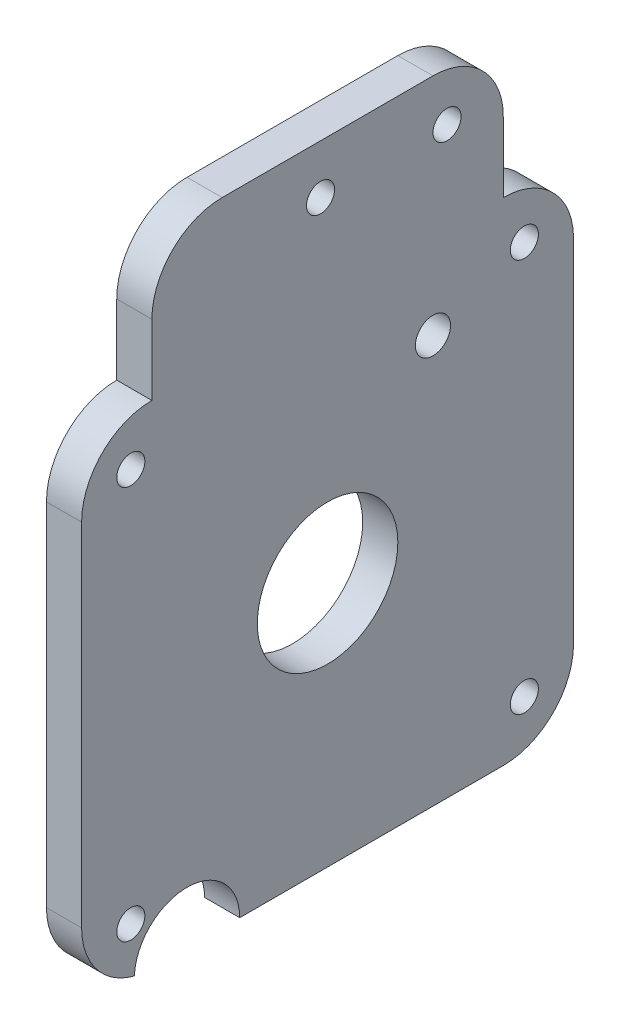
ISO-10303-21;
HEADER;
FILE_DESCRIPTION(('STEP AP214'),'2;1');
FILE_NAME('part.step','',(''),(''),'','','');
FILE_SCHEMA(('AUTOMOTIVE_DESIGN { 1 0 10303 214 1 1 1 1 }'));
ENDSEC;
DATA;
#1=APPLICATION_CONTEXT('core data for automotive mechanical design processes');
#2=APPLICATION_PROTOCOL_DEFINITION('international standard','automotive_design',2000,#1);
#3=PRODUCT_CONTEXT('',#1,'mechanical');
#4=PRODUCT('Part','Part','',(#3));
#5=PRODUCT_RELATED_PRODUCT_CATEGORY('part','',(#4));
#6=PRODUCT_DEFINITION_FORMATION('','',#4);
#7=PRODUCT_DEFINITION_CONTEXT('part definition',#1,'design');
#8=PRODUCT_DEFINITION('design','',#6,#7);
#9=PRODUCT_DEFINITION_SHAPE('','',#8);
#10=(LENGTH_UNIT() NAMED_UNIT(*) SI_UNIT(.MILLI.,.METRE.));
#11=(NAMED_UNIT(*) PLANE_ANGLE_UNIT() SI_UNIT($,.RADIAN.));
#12=(NAMED_UNIT(*) SI_UNIT($,.STERADIAN.) SOLID_ANGLE_UNIT());
#13=UNCERTAINTY_MEASURE_WITH_UNIT(LENGTH_MEASURE(1.E-05),#10,'distance_accuracy_value','');
#14=(GEOMETRIC_REPRESENTATION_CONTEXT(3) GLOBAL_UNCERTAINTY_ASSIGNED_CONTEXT((#13)) GLOBAL_UNIT_ASSIGNED_CONTEXT((#10,
#11,#12)) REPRESENTATION_CONTEXT('',''));
#15=CARTESIAN_POINT('',(0.,0.,0.));
#16=DIRECTION('',(0.,0.,1.));
#17=DIRECTION('',(1.,0.,0.));
#18=AXIS2_PLACEMENT_3D('',#15,#16,#17);
#19=CARTESIAN_POINT('',(5.,10.,-10.));
#20=DIRECTION('',(-1.,0.,0.));
#21=DIRECTION('',(0.,0.,1.));
#22=AXIS2_PLACEMENT_3D('',#19,#20,#21);
#23=PLANE('',#22);
#24=CARTESIAN_POINT('',(5.,58.,-50.));
#25=DIRECTION('',(1.,0.,0.));
#26=DIRECTION('',(0.,0.,-1.));
#27=AXIS2_PLACEMENT_3D('',#24,#25,#26);
#28=CIRCLE('',#27,2.5);
#29=CARTESIAN_POINT('',(5.,58.,-52.5));
#30=VERTEX_POINT('',#29);
#31=EDGE_CURVE('E214',#30,#30,#28,.T.);
#32=ORIENTED_EDGE('',*,*,#31,.F.);
#33=EDGE_LOOP('',(#32));
#34=FACE_BOUND('',#33,.T.);
#35=CARTESIAN_POINT('',(5.,83.,-52.));
#36=DIRECTION('',(1.,0.,0.));
#37=DIRECTION('',(0.,0.,-1.));
#38=AXIS2_PLACEMENT_3D('',#35,#36,#37);
#39=CIRCLE('',#38,2.);
#40=CARTESIAN_POINT('',(5.,83.,-54.));
#41=VERTEX_POINT('',#40);
#42=EDGE_CURVE('E523',#41,#41,#39,.T.);
#43=ORIENTED_EDGE('',*,*,#42,.F.);
#44=EDGE_LOOP('',(#43));
#45=FACE_BOUND('',#44,.T.);
#46=CARTESIAN_POINT('',(5.,83.,-34.));
#47=DIRECTION('',(1.,0.,0.));
#48=DIRECTION('',(0.,0.,-1.));
#49=AXIS2_PLACEMENT_3D('',#46,#47,#48);
#50=CIRCLE('',#49,2.);
#51=CARTESIAN_POINT('',(5.,83.,-36.));
#52=VERTEX_POINT('',#51);
#53=EDGE_CURVE('E229',#52,#52,#50,.T.);
#54=ORIENTED_EDGE('',*,*,#53,.F.);
#55=EDGE_LOOP('',(#54));
#56=FACE_BOUND('',#55,.T.);
#57=CARTESIAN_POINT('',(5.,10.,-10.));
#58=DIRECTION('',(1.,0.,0.));
#59=DIRECTION('',(0.,0.,1.));
#60=AXIS2_PLACEMENT_3D('',#57,#58,#59);
#61=CIRCLE('',#60,10.);
#62=CARTESIAN_POINT('',(5.,10.0000000000001,0.));
#63=VERTEX_POINT('',#62);
#64=CARTESIAN_POINT('',(5.,0.315826351423624,-7.50665270284725));
#65=VERTEX_POINT('',#64);
#66=EDGE_CURVE('E187',#63,#65,#61,.T.);
#67=ORIENTED_EDGE('',*,*,#66,.T.);
#68=CARTESIAN_POINT('',(5.,0.,-15.));
#69=DIRECTION('',(1.,0.,0.));
#70=DIRECTION('',(0.,0.,-1.));
#71=AXIS2_PLACEMENT_3D('',#68,#69,#70);
#72=CIRCLE('',#71,7.5);
#73=CARTESIAN_POINT('',(5.,0.,-22.5));
#74=VERTEX_POINT('',#73);
#75=EDGE_CURVE('E219',#74,#65,#72,.T.);
#76=ORIENTED_EDGE('',*,*,#75,.F.);
#77=DIRECTION('',(0.,0.,-1.));
#78=VECTOR('',#77,1.);
#79=CARTESIAN_POINT('',(5.,0.,-10.0000000000001));
#80=LINE('',#79,#78);
#81=CARTESIAN_POINT('',(5.,0.,-60.));
#82=VERTEX_POINT('',#81);
#83=EDGE_CURVE('E110',#74,#82,#80,.T.);
#84=ORIENTED_EDGE('',*,*,#83,.T.);
#85=CARTESIAN_POINT('',(5.,9.99999999999999,-60.));
#86=DIRECTION('',(1.,0.,0.));
#87=DIRECTION('',(0.,0.,-1.));
#88=AXIS2_PLACEMENT_3D('',#85,#86,#87);
#89=CIRCLE('',#88,10.);
#90=CARTESIAN_POINT('',(5.,9.99999999999999,-70.));
#91=VERTEX_POINT('',#90);
#92=EDGE_CURVE('E264',#82,#91,#89,.T.);
#93=ORIENTED_EDGE('',*,*,#92,.T.);
#94=DIRECTION('',(0.,1.,0.));
#95=VECTOR('',#94,1.);
#96=CARTESIAN_POINT('',(5.,10.,-70.));
#97=LINE('',#96,#95);
#98=CARTESIAN_POINT('',(5.,60.,-70.));
#99=VERTEX_POINT('',#98);
#100=EDGE_CURVE('E266',#91,#99,#97,.T.);
#101=ORIENTED_EDGE('',*,*,#100,.T.);
#102=CARTESIAN_POINT('',(5.,60.,-60.));
#103=DIRECTION('',(1.,0.,0.));
#104=DIRECTION('',(0.,0.,1.));
#105=AXIS2_PLACEMENT_3D('',#102,#103,#104);
#106=CIRCLE('',#105,10.);
#107=CARTESIAN_POINT('',(5.,70.,-60.));
#108=VERTEX_POINT('',#107);
#109=EDGE_CURVE('E268',#99,#108,#106,.T.);
#110=ORIENTED_EDGE('',*,*,#109,.T.);
#111=DIRECTION('',(0.,1.,0.));
#112=VECTOR('',#111,1.);
#113=CARTESIAN_POINT('',(5.,70.,-60.));
#114=LINE('',#113,#112);
#115=CARTESIAN_POINT('',(5.,80.,-60.));
#116=VERTEX_POINT('',#115);
#117=EDGE_CURVE('E270',#108,#116,#114,.T.);
#118=ORIENTED_EDGE('',*,*,#117,.T.);
#119=CARTESIAN_POINT('',(5.,80.,-50.));
#120=DIRECTION('',(1.,0.,0.));
#121=DIRECTION('',(0.,0.,-1.));
#122=AXIS2_PLACEMENT_3D('',#119,#120,#121);
#123=CIRCLE('',#122,9.99999999999999);
#124=CARTESIAN_POINT('',(5.,90.,-50.));
#125=VERTEX_POINT('',#124);
#126=EDGE_CURVE('E272',#116,#125,#123,.T.);
#127=ORIENTED_EDGE('',*,*,#126,.T.);
#128=DIRECTION('',(0.,0.,1.));
#129=VECTOR('',#128,1.);
#130=CARTESIAN_POINT('',(5.,90.,-50.));
#131=LINE('',#130,#129);
#132=CARTESIAN_POINT('',(5.,90.,-20.));
#133=VERTEX_POINT('',#132);
#134=EDGE_CURVE('E274',#125,#133,#131,.T.);
#135=ORIENTED_EDGE('',*,*,#134,.T.);
#136=CARTESIAN_POINT('',(5.,80.,-20.));
#137=DIRECTION('',(1.,0.,0.));
#138=DIRECTION('',(0.,0.,-1.));
#139=AXIS2_PLACEMENT_3D('',#136,#137,#138);
#140=CIRCLE('',#139,9.99999999999999);
#141=CARTESIAN_POINT('',(5.,80.,-10.));
#142=VERTEX_POINT('',#141);
#143=EDGE_CURVE('E142',#133,#142,#140,.T.);
#144=ORIENTED_EDGE('',*,*,#143,.T.);
#145=DIRECTION('',(0.,-1.,0.));
#146=VECTOR('',#145,1.);
#147=CARTESIAN_POINT('',(5.,70.,-10.));
#148=LINE('',#147,#146);
#149=CARTESIAN_POINT('',(5.,70.,-10.));
#150=VERTEX_POINT('',#149);
#151=EDGE_CURVE('E135',#142,#150,#148,.T.);
#152=ORIENTED_EDGE('',*,*,#151,.T.);
#153=CARTESIAN_POINT('',(5.,60.,-10.));
#154=DIRECTION('',(1.,0.,0.));
#155=DIRECTION('',(0.,0.,1.));
#156=AXIS2_PLACEMENT_3D('',#153,#154,#155);
#157=CIRCLE('',#156,10.);
#158=CARTESIAN_POINT('',(5.,60.,0.));
#159=VERTEX_POINT('',#158);
#160=EDGE_CURVE('E139',#150,#159,#157,.T.);
#161=ORIENTED_EDGE('',*,*,#160,.T.);
#162=DIRECTION('',(0.,-1.,0.));
#163=VECTOR('',#162,1.);
#164=CARTESIAN_POINT('',(5.,10.0000000000001,0.));
#165=LINE('',#164,#163);
#166=EDGE_CURVE('E60',#159,#63,#165,.T.);
#167=ORIENTED_EDGE('',*,*,#166,.T.);
#168=EDGE_LOOP('',(#67,#76,#84,#93,#101,#110,#118,#127,#135,#144,#152,#161,#167));
#169=FACE_BOUND('',#168,.T.);
#170=CARTESIAN_POINT('',(5.,63.,-7.));
#171=DIRECTION('',(1.,0.,0.));
#172=DIRECTION('',(0.,0.,-1.));
#173=AXIS2_PLACEMENT_3D('',#170,#171,#172);
#174=CIRCLE('',#173,2.);
#175=CARTESIAN_POINT('',(5.,63.,-9.));
#176=VERTEX_POINT('',#175);
#177=EDGE_CURVE('E167',#176,#176,#174,.T.);
#178=ORIENTED_EDGE('',*,*,#177,.F.);
#179=EDGE_LOOP('',(#178));
#180=FACE_BOUND('',#179,.T.);
#181=CARTESIAN_POINT('',(5.,63.,-63.));
#182=DIRECTION('',(1.,0.,0.));
#183=DIRECTION('',(0.,0.,1.));
#184=AXIS2_PLACEMENT_3D('',#181,#182,#183);
#185=CIRCLE('',#184,2.);
#186=CARTESIAN_POINT('',(5.,63.,-61.));
#187=VERTEX_POINT('',#186);
#188=EDGE_CURVE('E252',#187,#187,#185,.T.);
#189=ORIENTED_EDGE('',*,*,#188,.F.);
#190=EDGE_LOOP('',(#189));
#191=FACE_BOUND('',#190,.T.);
#192=CARTESIAN_POINT('',(5.,6.99999999999999,-63.));
#193=DIRECTION('',(1.,0.,0.));
#194=DIRECTION('',(0.,0.,-1.));
#195=AXIS2_PLACEMENT_3D('',#192,#193,#194);
#196=CIRCLE('',#195,2.);
#197=CARTESIAN_POINT('',(5.,6.99999999999999,-65.));
#198=VERTEX_POINT('',#197);
#199=EDGE_CURVE('E246',#198,#198,#196,.T.);
#200=ORIENTED_EDGE('',*,*,#199,.F.);
#201=EDGE_LOOP('',(#200));
#202=FACE_BOUND('',#201,.T.);
#203=CARTESIAN_POINT('',(5.,7.,-7.));
#204=DIRECTION('',(1.,0.,0.));
#205=DIRECTION('',(0.,0.,1.));
#206=AXIS2_PLACEMENT_3D('',#203,#204,#205);
#207=CIRCLE('',#206,2.);
#208=CARTESIAN_POINT('',(5.,7.,-5.));
#209=VERTEX_POINT('',#208);
#210=EDGE_CURVE('E240',#209,#209,#207,.T.);
#211=ORIENTED_EDGE('',*,*,#210,.F.);
#212=EDGE_LOOP('',(#211));
#213=FACE_BOUND('',#212,.T.);
#214=CARTESIAN_POINT('',(5.,35.,-35.));
#215=DIRECTION('',(1.,0.,0.));
#216=DIRECTION('',(0.,0.,-1.));
#217=AXIS2_PLACEMENT_3D('',#214,#215,#216);
#218=CIRCLE('',#217,9.99999999999999);
#219=CARTESIAN_POINT('',(5.,35.,-45.));
#220=VERTEX_POINT('',#219);
#221=EDGE_CURVE('E234',#220,#220,#218,.T.);
#222=ORIENTED_EDGE('',*,*,#221,.F.);
#223=EDGE_LOOP('',(#222));
#224=FACE_BOUND('',#223,.T.);
#225=ADVANCED_FACE('F35',(#34,#45,#56,#169,#180,#191,#202,#213,#224),#23,.F.);
#226=CARTESIAN_POINT('',(0.,10.,-10.));
#227=DIRECTION('',(-1.,0.,0.));
#228=DIRECTION('',(0.,0.,1.));
#229=AXIS2_PLACEMENT_3D('',#226,#227,#228);
#230=PLANE('',#229);
#231=CARTESIAN_POINT('',(0.,58.,-50.));
#232=DIRECTION('',(-1.,0.,0.));
#233=DIRECTION('',(0.,0.,1.));
#234=AXIS2_PLACEMENT_3D('',#231,#232,#233);
#235=CIRCLE('',#234,2.5);
#236=CARTESIAN_POINT('',(0.,58.,-47.5));
#237=VERTEX_POINT('',#236);
#238=EDGE_CURVE('E39',#237,#237,#235,.T.);
#239=ORIENTED_EDGE('',*,*,#238,.F.);
#240=EDGE_LOOP('',(#239));
#241=FACE_BOUND('',#240,.T.);
#242=CARTESIAN_POINT('',(0.,83.,-52.));
#243=DIRECTION('',(-1.,0.,0.));
#244=DIRECTION('',(0.,0.,1.));
#245=AXIS2_PLACEMENT_3D('',#242,#243,#244);
#246=CIRCLE('',#245,2.);
#247=CARTESIAN_POINT('',(0.,83.,-50.));
#248=VERTEX_POINT('',#247);
#249=EDGE_CURVE('E213',#248,#248,#246,.T.);
#250=ORIENTED_EDGE('',*,*,#249,.F.);
#251=EDGE_LOOP('',(#250));
#252=FACE_BOUND('',#251,.T.);
#253=CARTESIAN_POINT('',(0.,83.,-34.));
#254=DIRECTION('',(-1.,0.,0.));
#255=DIRECTION('',(0.,0.,1.));
#256=AXIS2_PLACEMENT_3D('',#253,#254,#255);
#257=CIRCLE('',#256,2.);
#258=CARTESIAN_POINT('',(0.,83.,-32.));
#259=VERTEX_POINT('',#258);
#260=EDGE_CURVE('E211',#259,#259,#257,.T.);
#261=ORIENTED_EDGE('',*,*,#260,.F.);
#262=EDGE_LOOP('',(#261));
#263=FACE_BOUND('',#262,.T.);
#264=CARTESIAN_POINT('',(0.,0.,-15.));
#265=DIRECTION('',(-1.,0.,0.));
#266=DIRECTION('',(0.,0.,1.));
#267=AXIS2_PLACEMENT_3D('',#264,#265,#266);
#268=CIRCLE('',#267,7.5);
#269=CARTESIAN_POINT('',(0.,0.315826351423625,-7.50665270284725));
#270=VERTEX_POINT('',#269);
#271=CARTESIAN_POINT('',(0.,0.,-22.5));
#272=VERTEX_POINT('',#271);
#273=EDGE_CURVE('E52',#270,#272,#268,.T.);
#274=ORIENTED_EDGE('',*,*,#273,.F.);
#275=CARTESIAN_POINT('',(0.,10.,-10.));
#276=DIRECTION('',(1.,0.,0.));
#277=DIRECTION('',(0.,0.,1.));
#278=AXIS2_PLACEMENT_3D('',#275,#276,#277);
#279=CIRCLE('',#278,10.);
#280=CARTESIAN_POINT('',(0.,10.0000000000001,0.));
#281=VERTEX_POINT('',#280);
#282=EDGE_CURVE('E163',#281,#270,#279,.T.);
#283=ORIENTED_EDGE('',*,*,#282,.F.);
#284=DIRECTION('',(0.,-1.,0.));
#285=VECTOR('',#284,1.);
#286=CARTESIAN_POINT('',(0.,10.0000000000001,0.));
#287=LINE('',#286,#285);
#288=CARTESIAN_POINT('',(0.,60.,0.));
#289=VERTEX_POINT('',#288);
#290=EDGE_CURVE('E102',#289,#281,#287,.T.);
#291=ORIENTED_EDGE('',*,*,#290,.F.);
#292=CARTESIAN_POINT('',(0.,60.,-10.));
#293=DIRECTION('',(1.,0.,0.));
#294=DIRECTION('',(0.,0.,1.));
#295=AXIS2_PLACEMENT_3D('',#292,#293,#294);
#296=CIRCLE('',#295,10.);
#297=CARTESIAN_POINT('',(0.,70.,-10.));
#298=VERTEX_POINT('',#297);
#299=EDGE_CURVE('E184',#298,#289,#296,.T.);
#300=ORIENTED_EDGE('',*,*,#299,.F.);
#301=DIRECTION('',(0.,-1.,0.));
#302=VECTOR('',#301,1.);
#303=CARTESIAN_POINT('',(0.,70.,-10.));
#304=LINE('',#303,#302);
#305=CARTESIAN_POINT('',(0.,80.,-10.));
#306=VERTEX_POINT('',#305);
#307=EDGE_CURVE('E151',#306,#298,#304,.T.);
#308=ORIENTED_EDGE('',*,*,#307,.F.);
#309=CARTESIAN_POINT('',(0.,80.,-20.));
#310=DIRECTION('',(1.,0.,0.));
#311=DIRECTION('',(0.,0.,-1.));
#312=AXIS2_PLACEMENT_3D('',#309,#310,#311);
#313=CIRCLE('',#312,9.99999999999999);
#314=CARTESIAN_POINT('',(0.,90.,-20.));
#315=VERTEX_POINT('',#314);
#316=EDGE_CURVE('E181',#315,#306,#313,.T.);
#317=ORIENTED_EDGE('',*,*,#316,.F.);
#318=DIRECTION('',(0.,0.,1.));
#319=VECTOR('',#318,1.);
#320=CARTESIAN_POINT('',(0.,90.,-50.));
#321=LINE('',#320,#319);
#322=CARTESIAN_POINT('',(0.,90.,-50.));
#323=VERTEX_POINT('',#322);
#324=EDGE_CURVE('E179',#323,#315,#321,.T.);
#325=ORIENTED_EDGE('',*,*,#324,.F.);
#326=CARTESIAN_POINT('',(0.,80.,-50.));
#327=DIRECTION('',(1.,0.,0.));
#328=DIRECTION('',(0.,0.,-1.));
#329=AXIS2_PLACEMENT_3D('',#326,#327,#328);
#330=CIRCLE('',#329,9.99999999999999);
#331=CARTESIAN_POINT('',(0.,80.,-60.));
#332=VERTEX_POINT('',#331);
#333=EDGE_CURVE('E177',#332,#323,#330,.T.);
#334=ORIENTED_EDGE('',*,*,#333,.F.);
#335=DIRECTION('',(0.,1.,0.));
#336=VECTOR('',#335,1.);
#337=CARTESIAN_POINT('',(0.,70.,-60.));
#338=LINE('',#337,#336);
#339=CARTESIAN_POINT('',(0.,70.,-60.));
#340=VERTEX_POINT('',#339);
#341=EDGE_CURVE('E175',#340,#332,#338,.T.);
#342=ORIENTED_EDGE('',*,*,#341,.F.);
#343=CARTESIAN_POINT('',(0.,60.,-60.));
#344=DIRECTION('',(1.,0.,0.));
#345=DIRECTION('',(0.,0.,1.));
#346=AXIS2_PLACEMENT_3D('',#343,#344,#345);
#347=CIRCLE('',#346,10.);
#348=CARTESIAN_POINT('',(0.,60.,-70.));
#349=VERTEX_POINT('',#348);
#350=EDGE_CURVE('E173',#349,#340,#347,.T.);
#351=ORIENTED_EDGE('',*,*,#350,.F.);
#352=DIRECTION('',(0.,1.,0.));
#353=VECTOR('',#352,1.);
#354=CARTESIAN_POINT('',(0.,10.,-70.));
#355=LINE('',#354,#353);
#356=CARTESIAN_POINT('',(0.,9.99999999999999,-70.));
#357=VERTEX_POINT('',#356);
#358=EDGE_CURVE('E171',#357,#349,#355,.T.);
#359=ORIENTED_EDGE('',*,*,#358,.F.);
#360=CARTESIAN_POINT('',(0.,9.99999999999999,-60.));
#361=DIRECTION('',(1.,0.,0.));
#362=DIRECTION('',(0.,0.,-1.));
#363=AXIS2_PLACEMENT_3D('',#360,#361,#362);
#364=CIRCLE('',#363,10.);
#365=CARTESIAN_POINT('',(0.,0.,-60.));
#366=VERTEX_POINT('',#365);
#367=EDGE_CURVE('E169',#366,#357,#364,.T.);
#368=ORIENTED_EDGE('',*,*,#367,.F.);
#369=DIRECTION('',(0.,0.,-1.));
#370=VECTOR('',#369,1.);
#371=CARTESIAN_POINT('',(0.,0.,-10.0000000000001));
#372=LINE('',#371,#370);
#373=EDGE_CURVE('E166',#272,#366,#372,.T.);
#374=ORIENTED_EDGE('',*,*,#373,.F.);
#375=EDGE_LOOP('',(#274,#283,#291,#300,#308,#317,#325,#334,#342,#351,#359,#368,#374));
#376=FACE_BOUND('',#375,.T.);
#377=CARTESIAN_POINT('',(0.,7.,-7.));
#378=DIRECTION('',(1.,0.,0.));
#379=DIRECTION('',(0.,0.,1.));
#380=AXIS2_PLACEMENT_3D('',#377,#378,#379);
#381=CIRCLE('',#380,2.);
#382=CARTESIAN_POINT('',(0.,7.,-5.));
#383=VERTEX_POINT('',#382);
#384=EDGE_CURVE('E237',#383,#383,#381,.T.);
#385=ORIENTED_EDGE('',*,*,#384,.T.);
#386=EDGE_LOOP('',(#385));
#387=FACE_BOUND('',#386,.T.);
#388=CARTESIAN_POINT('',(0.,63.,-63.));
#389=DIRECTION('',(1.,0.,0.));
#390=DIRECTION('',(0.,0.,1.));
#391=AXIS2_PLACEMENT_3D('',#388,#389,#390);
#392=CIRCLE('',#391,2.);
#393=CARTESIAN_POINT('',(0.,63.,-61.));
#394=VERTEX_POINT('',#393);
#395=EDGE_CURVE('E249',#394,#394,#392,.T.);
#396=ORIENTED_EDGE('',*,*,#395,.T.);
#397=EDGE_LOOP('',(#396));
#398=FACE_BOUND('',#397,.T.);
#399=CARTESIAN_POINT('',(0.,63.,-7.));
#400=DIRECTION('',(1.,0.,0.));
#401=DIRECTION('',(0.,0.,-1.));
#402=AXIS2_PLACEMENT_3D('',#399,#400,#401);
#403=CIRCLE('',#402,2.);
#404=CARTESIAN_POINT('',(0.,63.,-9.));
#405=VERTEX_POINT('',#404);
#406=EDGE_CURVE('E255',#405,#405,#403,.T.);
#407=ORIENTED_EDGE('',*,*,#406,.T.);
#408=EDGE_LOOP('',(#407));
#409=FACE_BOUND('',#408,.T.);
#410=CARTESIAN_POINT('',(0.,6.99999999999999,-63.));
#411=DIRECTION('',(1.,0.,0.));
#412=DIRECTION('',(0.,0.,-1.));
#413=AXIS2_PLACEMENT_3D('',#410,#411,#412);
#414=CIRCLE('',#413,2.);
#415=CARTESIAN_POINT('',(0.,6.99999999999999,-65.));
#416=VERTEX_POINT('',#415);
#417=EDGE_CURVE('E243',#416,#416,#414,.T.);
#418=ORIENTED_EDGE('',*,*,#417,.T.);
#419=EDGE_LOOP('',(#418));
#420=FACE_BOUND('',#419,.T.);
#421=CARTESIAN_POINT('',(0.,35.,-35.));
#422=DIRECTION('',(1.,0.,0.));
#423=DIRECTION('',(0.,0.,-1.));
#424=AXIS2_PLACEMENT_3D('',#421,#422,#423);
#425=CIRCLE('',#424,9.99999999999999);
#426=CARTESIAN_POINT('',(0.,35.,-45.));
#427=VERTEX_POINT('',#426);
#428=EDGE_CURVE('E233',#427,#427,#425,.T.);
#429=ORIENTED_EDGE('',*,*,#428,.T.);
#430=EDGE_LOOP('',(#429));
#431=FACE_BOUND('',#430,.T.);
#432=ADVANCED_FACE('F286',(#241,#252,#263,#376,#387,#398,#409,#420,#431),#230,.T.);
#433=CARTESIAN_POINT('',(5.,10.,-10.));
#434=DIRECTION('',(-1.,0.,0.));
#435=DIRECTION('',(0.,0.,1.));
#436=AXIS2_PLACEMENT_3D('',#433,#434,#435);
#437=CYLINDRICAL_SURFACE('',#436,10.);
#438=ORIENTED_EDGE('',*,*,#282,.T.);
#439=DIRECTION('',(1.,0.,0.));
#440=VECTOR('',#439,1.);
#441=CARTESIAN_POINT('',(0.,0.315826351423624,-7.50665270284725));
#442=LINE('',#441,#440);
#443=EDGE_CURVE('E226',#270,#65,#442,.T.);
#444=ORIENTED_EDGE('',*,*,#443,.T.);
#445=ORIENTED_EDGE('',*,*,#66,.F.);
#446=DIRECTION('',(-1.,0.,0.));
#447=VECTOR('',#446,1.);
#448=CARTESIAN_POINT('',(5.,10.0000000000001,0.));
#449=LINE('',#448,#447);
#450=EDGE_CURVE('E159',#63,#281,#449,.T.);
#451=ORIENTED_EDGE('',*,*,#450,.T.);
#452=EDGE_LOOP('',(#438,#444,#445,#451));
#453=FACE_BOUND('',#452,.T.);
#454=ADVANCED_FACE('F37',(#453),#437,.T.);
#455=CARTESIAN_POINT('',(5.,0.,-10.0000000000001));
#456=DIRECTION('',(0.,1.,0.));
#457=DIRECTION('',(0.,0.,1.));
#458=AXIS2_PLACEMENT_3D('',#455,#456,#457);
#459=PLANE('',#458);
#460=ORIENTED_EDGE('',*,*,#83,.F.);
#461=DIRECTION('',(1.,0.,0.));
#462=VECTOR('',#461,1.);
#463=CARTESIAN_POINT('',(-5.,0.,-22.5));
#464=LINE('',#463,#462);
#465=EDGE_CURVE('E11',#74,#272,#464,.F.);
#466=ORIENTED_EDGE('',*,*,#465,.T.);
#467=ORIENTED_EDGE('',*,*,#373,.T.);
#468=DIRECTION('',(-1.,0.,0.));
#469=VECTOR('',#468,1.);
#470=CARTESIAN_POINT('',(5.,0.,-60.));
#471=LINE('',#470,#469);
#472=EDGE_CURVE('E44',#82,#366,#471,.T.);
#473=ORIENTED_EDGE('',*,*,#472,.F.);
#474=EDGE_LOOP('',(#460,#466,#467,#473));
#475=FACE_BOUND('',#474,.T.);
#476=ADVANCED_FACE('F297',(#475),#459,.F.);
#477=CARTESIAN_POINT('',(5.,9.99999999999999,-60.));
#478=DIRECTION('',(-1.,0.,0.));
#479=DIRECTION('',(0.,0.,1.));
#480=AXIS2_PLACEMENT_3D('',#477,#478,#479);
#481=CYLINDRICAL_SURFACE('',#480,10.);
#482=ORIENTED_EDGE('',*,*,#367,.T.);
#483=DIRECTION('',(-1.,0.,0.));
#484=VECTOR('',#483,1.);
#485=CARTESIAN_POINT('',(5.,9.99999999999999,-70.));
#486=LINE('',#485,#484);
#487=EDGE_CURVE('E206',#91,#357,#486,.T.);
#488=ORIENTED_EDGE('',*,*,#487,.F.);
#489=ORIENTED_EDGE('',*,*,#92,.F.);
#490=ORIENTED_EDGE('',*,*,#472,.T.);
#491=EDGE_LOOP('',(#482,#488,#489,#490));
#492=FACE_BOUND('',#491,.T.);
#493=ADVANCED_FACE('F303',(#492),#481,.T.);
#494=CARTESIAN_POINT('',(5.,10.,-70.));
#495=DIRECTION('',(0.,0.,1.));
#496=DIRECTION('',(0.,-1.,0.));
#497=AXIS2_PLACEMENT_3D('',#494,#495,#496);
#498=PLANE('',#497);
#499=ORIENTED_EDGE('',*,*,#358,.T.);
#500=DIRECTION('',(-1.,0.,0.));
#501=VECTOR('',#500,1.);
#502=CARTESIAN_POINT('',(5.,60.,-70.));
#503=LINE('',#502,#501);
#504=EDGE_CURVE('E203',#99,#349,#503,.T.);
#505=ORIENTED_EDGE('',*,*,#504,.F.);
#506=ORIENTED_EDGE('',*,*,#100,.F.);
#507=ORIENTED_EDGE('',*,*,#487,.T.);
#508=EDGE_LOOP('',(#499,#505,#506,#507));
#509=FACE_BOUND('',#508,.T.);
#510=ADVANCED_FACE('F307',(#509),#498,.F.);
#511=CARTESIAN_POINT('',(5.,60.,-60.));
#512=DIRECTION('',(-1.,0.,0.));
#513=DIRECTION('',(0.,0.,1.));
#514=AXIS2_PLACEMENT_3D('',#511,#512,#513);
#515=CYLINDRICAL_SURFACE('',#514,10.);
#516=ORIENTED_EDGE('',*,*,#350,.T.);
#517=DIRECTION('',(-1.,0.,0.));
#518=VECTOR('',#517,1.);
#519=CARTESIAN_POINT('',(5.,70.,-60.));
#520=LINE('',#519,#518);
#521=EDGE_CURVE('E200',#108,#340,#520,.T.);
#522=ORIENTED_EDGE('',*,*,#521,.F.);
#523=ORIENTED_EDGE('',*,*,#109,.F.);
#524=ORIENTED_EDGE('',*,*,#504,.T.);
#525=EDGE_LOOP('',(#516,#522,#523,#524));
#526=FACE_BOUND('',#525,.T.);
#527=ADVANCED_FACE('F314',(#526),#515,.T.);
#528=CARTESIAN_POINT('',(5.,70.,-60.));
#529=DIRECTION('',(0.,0.,1.));
#530=DIRECTION('',(0.,-1.,0.));
#531=AXIS2_PLACEMENT_3D('',#528,#529,#530);
#532=PLANE('',#531);
#533=ORIENTED_EDGE('',*,*,#341,.T.);
#534=DIRECTION('',(-1.,0.,0.));
#535=VECTOR('',#534,1.);
#536=CARTESIAN_POINT('',(5.,80.,-60.));
#537=LINE('',#536,#535);
#538=EDGE_CURVE('E197',#116,#332,#537,.T.);
#539=ORIENTED_EDGE('',*,*,#538,.F.);
#540=ORIENTED_EDGE('',*,*,#117,.F.);
#541=ORIENTED_EDGE('',*,*,#521,.T.);
#542=EDGE_LOOP('',(#533,#539,#540,#541));
#543=FACE_BOUND('',#542,.T.);
#544=ADVANCED_FACE('F317',(#543),#532,.F.);
#545=CARTESIAN_POINT('',(5.,80.,-50.));
#546=DIRECTION('',(-1.,0.,0.));
#547=DIRECTION('',(0.,0.,1.));
#548=AXIS2_PLACEMENT_3D('',#545,#546,#547);
#549=CYLINDRICAL_SURFACE('',#548,9.99999999999999);
#550=ORIENTED_EDGE('',*,*,#333,.T.);
#551=DIRECTION('',(-1.,0.,0.));
#552=VECTOR('',#551,1.);
#553=CARTESIAN_POINT('',(5.,90.,-50.));
#554=LINE('',#553,#552);
#555=EDGE_CURVE('E194',#125,#323,#554,.T.);
#556=ORIENTED_EDGE('',*,*,#555,.F.);
#557=ORIENTED_EDGE('',*,*,#126,.F.);
#558=ORIENTED_EDGE('',*,*,#538,.T.);
#559=EDGE_LOOP('',(#550,#556,#557,#558));
#560=FACE_BOUND('',#559,.T.);
#561=ADVANCED_FACE('F320',(#560),#549,.T.);
#562=CARTESIAN_POINT('',(5.,90.,-50.));
#563=DIRECTION('',(0.,-1.,0.));
#564=DIRECTION('',(0.,0.,-1.));
#565=AXIS2_PLACEMENT_3D('',#562,#563,#564);
#566=PLANE('',#565);
#567=ORIENTED_EDGE('',*,*,#324,.T.);
#568=DIRECTION('',(-1.,0.,0.));
#569=VECTOR('',#568,1.);
#570=CARTESIAN_POINT('',(5.,90.,-20.));
#571=LINE('',#570,#569);
#572=EDGE_CURVE('E191',#133,#315,#571,.T.);
#573=ORIENTED_EDGE('',*,*,#572,.F.);
#574=ORIENTED_EDGE('',*,*,#134,.F.);
#575=ORIENTED_EDGE('',*,*,#555,.T.);
#576=EDGE_LOOP('',(#567,#573,#574,#575));
#577=FACE_BOUND('',#576,.T.);
#578=ADVANCED_FACE('F280',(#577),#566,.F.);
#579=CARTESIAN_POINT('',(5.,80.,-20.));
#580=DIRECTION('',(-1.,0.,0.));
#581=DIRECTION('',(0.,0.,1.));
#582=AXIS2_PLACEMENT_3D('',#579,#580,#581);
#583=CYLINDRICAL_SURFACE('',#582,9.99999999999999);
#584=ORIENTED_EDGE('',*,*,#316,.T.);
#585=DIRECTION('',(-1.,0.,0.));
#586=VECTOR('',#585,1.);
#587=CARTESIAN_POINT('',(5.,80.,-10.));
#588=LINE('',#587,#586);
#589=EDGE_CURVE('E154',#142,#306,#588,.T.);
#590=ORIENTED_EDGE('',*,*,#589,.F.);
#591=ORIENTED_EDGE('',*,*,#143,.F.);
#592=ORIENTED_EDGE('',*,*,#572,.T.);
#593=EDGE_LOOP('',(#584,#590,#591,#592));
#594=FACE_BOUND('',#593,.T.);
#595=ADVANCED_FACE('F284',(#594),#583,.T.);
#596=CARTESIAN_POINT('',(5.,70.,-10.));
#597=DIRECTION('',(0.,0.,-1.));
#598=DIRECTION('',(-1.,0.,0.));
#599=AXIS2_PLACEMENT_3D('',#596,#597,#598);
#600=PLANE('',#599);
#601=ORIENTED_EDGE('',*,*,#307,.T.);
#602=DIRECTION('',(-1.,0.,0.));
#603=VECTOR('',#602,1.);
#604=CARTESIAN_POINT('',(5.,70.,-10.));
#605=LINE('',#604,#603);
#606=EDGE_CURVE('E148',#150,#298,#605,.T.);
#607=ORIENTED_EDGE('',*,*,#606,.F.);
#608=ORIENTED_EDGE('',*,*,#151,.F.);
#609=ORIENTED_EDGE('',*,*,#589,.T.);
#610=EDGE_LOOP('',(#601,#607,#608,#609));
#611=FACE_BOUND('',#610,.T.);
#612=ADVANCED_FACE('F149',(#611),#600,.F.);
#613=CARTESIAN_POINT('',(5.,60.,-10.));
#614=DIRECTION('',(-1.,0.,0.));
#615=DIRECTION('',(0.,0.,1.));
#616=AXIS2_PLACEMENT_3D('',#613,#614,#615);
#617=CYLINDRICAL_SURFACE('',#616,10.);
#618=ORIENTED_EDGE('',*,*,#299,.T.);
#619=DIRECTION('',(-1.,0.,0.));
#620=VECTOR('',#619,1.);
#621=CARTESIAN_POINT('',(5.,60.,0.));
#622=LINE('',#621,#620);
#623=EDGE_CURVE('E155',#159,#289,#622,.T.);
#624=ORIENTED_EDGE('',*,*,#623,.F.);
#625=ORIENTED_EDGE('',*,*,#160,.F.);
#626=ORIENTED_EDGE('',*,*,#606,.T.);
#627=EDGE_LOOP('',(#618,#624,#625,#626));
#628=FACE_BOUND('',#627,.T.);
#629=ADVANCED_FACE('F157',(#628),#617,.T.);
#630=CARTESIAN_POINT('',(5.,10.0000000000001,0.));
#631=DIRECTION('',(0.,0.,-1.));
#632=DIRECTION('',(-1.,0.,0.));
#633=AXIS2_PLACEMENT_3D('',#630,#631,#632);
#634=PLANE('',#633);
#635=ORIENTED_EDGE('',*,*,#290,.T.);
#636=ORIENTED_EDGE('',*,*,#450,.F.);
#637=ORIENTED_EDGE('',*,*,#166,.F.);
#638=ORIENTED_EDGE('',*,*,#623,.T.);
#639=EDGE_LOOP('',(#635,#636,#637,#638));
#640=FACE_BOUND('',#639,.T.);
#641=ADVANCED_FACE('F289',(#640),#634,.F.);
#642=CARTESIAN_POINT('',(5.,63.,-7.));
#643=DIRECTION('',(-1.,0.,0.));
#644=DIRECTION('',(0.,0.,1.));
#645=AXIS2_PLACEMENT_3D('',#642,#643,#644);
#646=CYLINDRICAL_SURFACE('',#645,2.);
#647=ORIENTED_EDGE('',*,*,#177,.T.);
#648=EDGE_LOOP('',(#647));
#649=FACE_BOUND('',#648,.T.);
#650=ORIENTED_EDGE('',*,*,#406,.F.);
#651=EDGE_LOOP('',(#650));
#652=FACE_BOUND('',#651,.T.);
#653=ADVANCED_FACE('F340',(#649,#652),#646,.F.);
#654=CARTESIAN_POINT('',(5.,63.,-63.));
#655=DIRECTION('',(-1.,0.,0.));
#656=DIRECTION('',(0.,0.,1.));
#657=AXIS2_PLACEMENT_3D('',#654,#655,#656);
#658=CYLINDRICAL_SURFACE('',#657,2.);
#659=ORIENTED_EDGE('',*,*,#188,.T.);
#660=EDGE_LOOP('',(#659));
#661=FACE_BOUND('',#660,.T.);
#662=ORIENTED_EDGE('',*,*,#395,.F.);
#663=EDGE_LOOP('',(#662));
#664=FACE_BOUND('',#663,.T.);
#665=ADVANCED_FACE('F372',(#661,#664),#658,.F.);
#666=CARTESIAN_POINT('',(5.,6.99999999999999,-63.));
#667=DIRECTION('',(-1.,0.,0.));
#668=DIRECTION('',(0.,0.,1.));
#669=AXIS2_PLACEMENT_3D('',#666,#667,#668);
#670=CYLINDRICAL_SURFACE('',#669,2.);
#671=ORIENTED_EDGE('',*,*,#199,.T.);
#672=EDGE_LOOP('',(#671));
#673=FACE_BOUND('',#672,.T.);
#674=ORIENTED_EDGE('',*,*,#417,.F.);
#675=EDGE_LOOP('',(#674));
#676=FACE_BOUND('',#675,.T.);
#677=ADVANCED_FACE('F379',(#673,#676),#670,.F.);
#678=CARTESIAN_POINT('',(5.,7.,-7.));
#679=DIRECTION('',(-1.,0.,0.));
#680=DIRECTION('',(0.,0.,1.));
#681=AXIS2_PLACEMENT_3D('',#678,#679,#680);
#682=CYLINDRICAL_SURFACE('',#681,2.);
#683=ORIENTED_EDGE('',*,*,#210,.T.);
#684=EDGE_LOOP('',(#683));
#685=FACE_BOUND('',#684,.T.);
#686=ORIENTED_EDGE('',*,*,#384,.F.);
#687=EDGE_LOOP('',(#686));
#688=FACE_BOUND('',#687,.T.);
#689=ADVANCED_FACE('F386',(#685,#688),#682,.F.);
#690=CARTESIAN_POINT('',(5.,35.,-35.));
#691=DIRECTION('',(-1.,0.,0.));
#692=DIRECTION('',(0.,0.,1.));
#693=AXIS2_PLACEMENT_3D('',#690,#691,#692);
#694=CYLINDRICAL_SURFACE('',#693,9.99999999999999);
#695=ORIENTED_EDGE('',*,*,#221,.T.);
#696=EDGE_LOOP('',(#695));
#697=FACE_BOUND('',#696,.T.);
#698=ORIENTED_EDGE('',*,*,#428,.F.);
#699=EDGE_LOOP('',(#698));
#700=FACE_BOUND('',#699,.T.);
#701=ADVANCED_FACE('F394',(#697,#700),#694,.F.);
#702=CARTESIAN_POINT('',(-5.,0.,-15.));
#703=DIRECTION('',(1.,0.,0.));
#704=DIRECTION('',(0.,0.,-1.));
#705=AXIS2_PLACEMENT_3D('',#702,#703,#704);
#706=CYLINDRICAL_SURFACE('',#705,7.5);
#707=ORIENTED_EDGE('',*,*,#273,.T.);
#708=ORIENTED_EDGE('',*,*,#465,.F.);
#709=ORIENTED_EDGE('',*,*,#75,.T.);
#710=ORIENTED_EDGE('',*,*,#443,.F.);
#711=EDGE_LOOP('',(#707,#708,#709,#710));
#712=FACE_BOUND('',#711,.T.);
#713=ADVANCED_FACE('F294',(#712),#706,.F.);
#714=CARTESIAN_POINT('',(-5.,83.,-34.));
#715=DIRECTION('',(1.,0.,0.));
#716=DIRECTION('',(0.,0.,-1.));
#717=AXIS2_PLACEMENT_3D('',#714,#715,#716);
#718=CYLINDRICAL_SURFACE('',#717,2.);
#719=ORIENTED_EDGE('',*,*,#260,.T.);
#720=EDGE_LOOP('',(#719));
#721=FACE_BOUND('',#720,.T.);
#722=ORIENTED_EDGE('',*,*,#53,.T.);
#723=EDGE_LOOP('',(#722));
#724=FACE_BOUND('',#723,.T.);
#725=ADVANCED_FACE('F409',(#721,#724),#718,.F.);
#726=CARTESIAN_POINT('',(-5.,83.,-52.));
#727=DIRECTION('',(1.,0.,0.));
#728=DIRECTION('',(0.,0.,-1.));
#729=AXIS2_PLACEMENT_3D('',#726,#727,#728);
#730=CYLINDRICAL_SURFACE('',#729,2.);
#731=ORIENTED_EDGE('',*,*,#249,.T.);
#732=EDGE_LOOP('',(#731));
#733=FACE_BOUND('',#732,.T.);
#734=ORIENTED_EDGE('',*,*,#42,.T.);
#735=EDGE_LOOP('',(#734));
#736=FACE_BOUND('',#735,.T.);
#737=ADVANCED_FACE('F417',(#733,#736),#730,.F.);
#738=CARTESIAN_POINT('',(-5.,58.,-50.));
#739=DIRECTION('',(1.,0.,0.));
#740=DIRECTION('',(0.,0.,-1.));
#741=AXIS2_PLACEMENT_3D('',#738,#739,#740);
#742=CYLINDRICAL_SURFACE('',#741,2.5);
#743=ORIENTED_EDGE('',*,*,#238,.T.);
#744=EDGE_LOOP('',(#743));
#745=FACE_BOUND('',#744,.T.);
#746=ORIENTED_EDGE('',*,*,#31,.T.);
#747=EDGE_LOOP('',(#746));
#748=FACE_BOUND('',#747,.T.);
#749=ADVANCED_FACE('F425',(#745,#748),#742,.F.);
#750=CLOSED_SHELL('',(#225,#432,#454,#476,#493,#510,#527,#544,#561,#578,#595,#612,#629,#641,
#653,#665,#677,#689,#701,#713,#725,#737,#749));
#751=MANIFOLD_SOLID_BREP('B2',#750);
#752=ADVANCED_BREP_SHAPE_REPRESENTATION('',(#18,#751),#14);
#753=SHAPE_DEFINITION_REPRESENTATION(#9,#752);
ENDSEC;
END-ISO-10303-21;
